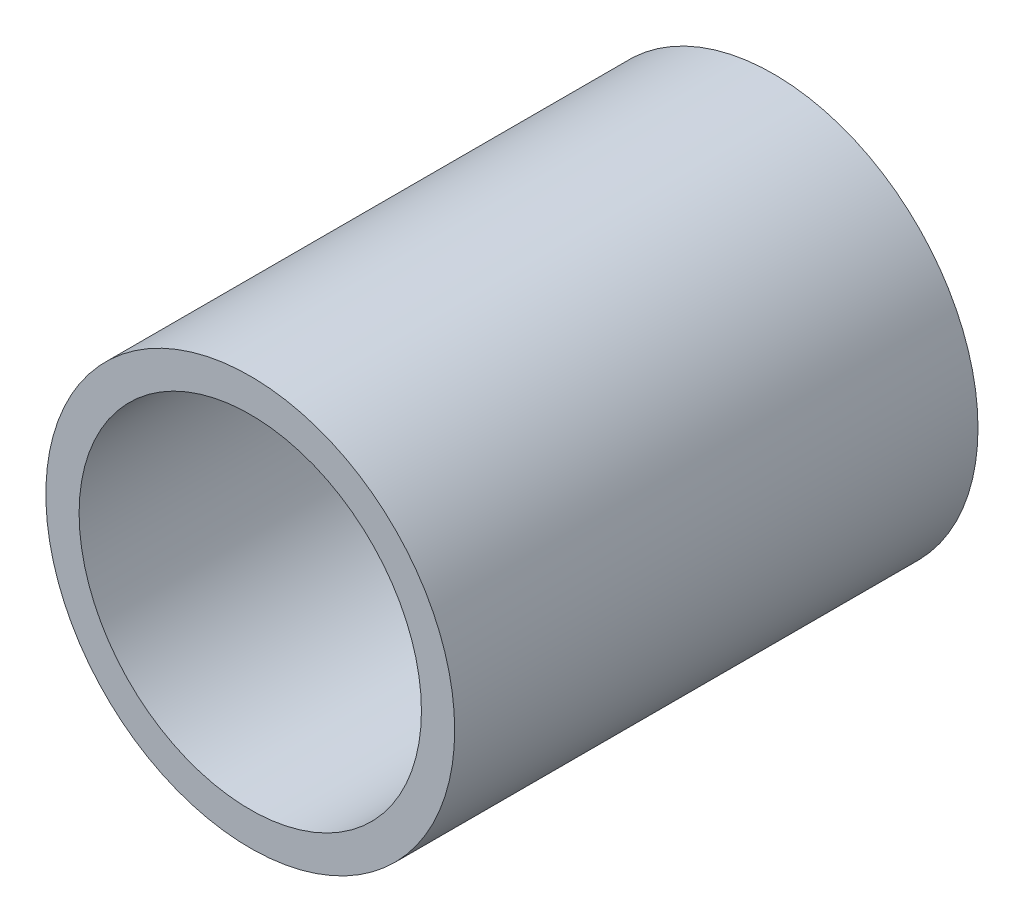
ISO-10303-21;
HEADER;
FILE_DESCRIPTION(('STEP AP214'),'2;1');
FILE_NAME('part.step','',(''),(''),'','','');
FILE_SCHEMA(('AUTOMOTIVE_DESIGN { 1 0 10303 214 1 1 1 1 }'));
ENDSEC;
DATA;
#1=APPLICATION_CONTEXT('core data for automotive mechanical design processes');
#2=APPLICATION_PROTOCOL_DEFINITION('international standard','automotive_design',2000,#1);
#3=PRODUCT_CONTEXT('',#1,'mechanical');
#4=PRODUCT('Part','Part','',(#3));
#5=PRODUCT_RELATED_PRODUCT_CATEGORY('part','',(#4));
#6=PRODUCT_DEFINITION_FORMATION('','',#4);
#7=PRODUCT_DEFINITION_CONTEXT('part definition',#1,'design');
#8=PRODUCT_DEFINITION('design','',#6,#7);
#9=PRODUCT_DEFINITION_SHAPE('','',#8);
#10=(LENGTH_UNIT() NAMED_UNIT(*) SI_UNIT(.MILLI.,.METRE.));
#11=(NAMED_UNIT(*) PLANE_ANGLE_UNIT() SI_UNIT($,.RADIAN.));
#12=(NAMED_UNIT(*) SI_UNIT($,.STERADIAN.) SOLID_ANGLE_UNIT());
#13=UNCERTAINTY_MEASURE_WITH_UNIT(LENGTH_MEASURE(1.E-05),#10,'distance_accuracy_value','');
#14=(GEOMETRIC_REPRESENTATION_CONTEXT(3) GLOBAL_UNCERTAINTY_ASSIGNED_CONTEXT((#13)) GLOBAL_UNIT_ASSIGNED_CONTEXT((#10,
#11,#12)) REPRESENTATION_CONTEXT('',''));
#15=CARTESIAN_POINT('',(0.,0.,0.));
#16=DIRECTION('',(0.,0.,1.));
#17=DIRECTION('',(1.,0.,0.));
#18=AXIS2_PLACEMENT_3D('',#15,#16,#17);
#19=CARTESIAN_POINT('',(-12.6029782359679,4.56857961053837,12.192));
#20=DIRECTION('',(0.,0.,1.));
#21=DIRECTION('',(1.,0.,0.));
#22=AXIS2_PLACEMENT_3D('',#19,#20,#21);
#23=PLANE('',#22);
#24=CARTESIAN_POINT('',(-12.6029782359679,4.56857961053837,12.192));
#25=DIRECTION('',(0.,0.,1.));
#26=DIRECTION('',(1.,0.,0.));
#27=AXIS2_PLACEMENT_3D('',#24,#25,#26);
#28=CIRCLE('',#27,4.7625);
#29=CARTESIAN_POINT('',(-7.84047823596793,4.56857961053837,12.192));
#30=VERTEX_POINT('',#29);
#31=EDGE_CURVE('E10',#30,#30,#28,.T.);
#32=ORIENTED_EDGE('',*,*,#31,.T.);
#33=EDGE_LOOP('',(#32));
#34=FACE_BOUND('',#33,.T.);
#35=CARTESIAN_POINT('',(-12.6029782359679,4.56857961053837,12.192));
#36=DIRECTION('',(0.,0.,1.));
#37=DIRECTION('',(1.,0.,0.));
#38=AXIS2_PLACEMENT_3D('',#35,#36,#37);
#39=CIRCLE('',#38,3.9878);
#40=CARTESIAN_POINT('',(-8.61517823596793,4.56857961053837,12.192));
#41=VERTEX_POINT('',#40);
#42=EDGE_CURVE('E41',#41,#41,#39,.T.);
#43=ORIENTED_EDGE('',*,*,#42,.F.);
#44=EDGE_LOOP('',(#43));
#45=FACE_BOUND('',#44,.T.);
#46=ADVANCED_FACE('F30',(#34,#45),#23,.T.);
#47=CARTESIAN_POINT('',(-12.6029782359679,4.56857961053837,0.));
#48=DIRECTION('',(0.,0.,1.));
#49=DIRECTION('',(1.,0.,0.));
#50=AXIS2_PLACEMENT_3D('',#47,#48,#49);
#51=PLANE('',#50);
#52=CARTESIAN_POINT('',(-12.6029782359679,4.56857961053837,0.));
#53=DIRECTION('',(0.,0.,1.));
#54=DIRECTION('',(1.,0.,0.));
#55=AXIS2_PLACEMENT_3D('',#52,#53,#54);
#56=CIRCLE('',#55,4.7625);
#57=CARTESIAN_POINT('',(-7.84047823596793,4.56857961053837,0.));
#58=VERTEX_POINT('',#57);
#59=EDGE_CURVE('E34',#58,#58,#56,.T.);
#60=ORIENTED_EDGE('',*,*,#59,.F.);
#61=EDGE_LOOP('',(#60));
#62=FACE_BOUND('',#61,.T.);
#63=CARTESIAN_POINT('',(-12.6029782359679,4.56857961053837,0.));
#64=DIRECTION('',(0.,0.,1.));
#65=DIRECTION('',(1.,0.,0.));
#66=AXIS2_PLACEMENT_3D('',#63,#64,#65);
#67=CIRCLE('',#66,3.9878);
#68=CARTESIAN_POINT('',(-8.61517823596793,4.56857961053837,0.));
#69=VERTEX_POINT('',#68);
#70=EDGE_CURVE('E43',#69,#69,#67,.T.);
#71=ORIENTED_EDGE('',*,*,#70,.T.);
#72=EDGE_LOOP('',(#71));
#73=FACE_BOUND('',#72,.T.);
#74=ADVANCED_FACE('F53',(#62,#73),#51,.F.);
#75=CARTESIAN_POINT('',(-12.6029782359679,4.56857961053837,12.192));
#76=DIRECTION('',(0.,0.,-1.));
#77=DIRECTION('',(-1.,0.,0.));
#78=AXIS2_PLACEMENT_3D('',#75,#76,#77);
#79=CYLINDRICAL_SURFACE('',#78,4.7625);
#80=ORIENTED_EDGE('',*,*,#31,.F.);
#81=EDGE_LOOP('',(#80));
#82=FACE_BOUND('',#81,.T.);
#83=ORIENTED_EDGE('',*,*,#59,.T.);
#84=EDGE_LOOP('',(#83));
#85=FACE_BOUND('',#84,.T.);
#86=ADVANCED_FACE('F32',(#82,#85),#79,.T.);
#87=CARTESIAN_POINT('',(-12.6029782359679,4.56857961053837,12.192));
#88=DIRECTION('',(0.,0.,-1.));
#89=DIRECTION('',(-1.,0.,0.));
#90=AXIS2_PLACEMENT_3D('',#87,#88,#89);
#91=CYLINDRICAL_SURFACE('',#90,3.9878);
#92=ORIENTED_EDGE('',*,*,#42,.T.);
#93=EDGE_LOOP('',(#92));
#94=FACE_BOUND('',#93,.T.);
#95=ORIENTED_EDGE('',*,*,#70,.F.);
#96=EDGE_LOOP('',(#95));
#97=FACE_BOUND('',#96,.T.);
#98=ADVANCED_FACE('F49',(#94,#97),#91,.F.);
#99=CLOSED_SHELL('',(#46,#74,#86,#98));
#100=MANIFOLD_SOLID_BREP('B2',#99);
#101=ADVANCED_BREP_SHAPE_REPRESENTATION('',(#18,#100),#14);
#102=SHAPE_DEFINITION_REPRESENTATION(#9,#101);
ENDSEC;
END-ISO-10303-21;
